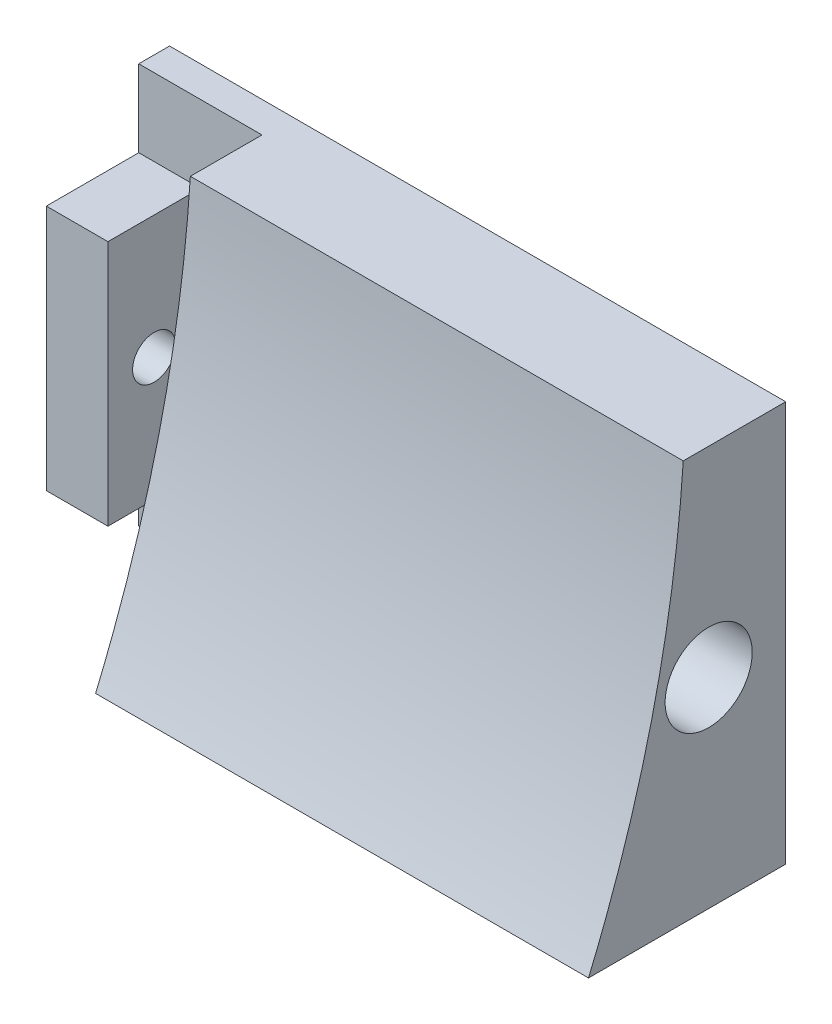
ISO-10303-21;
HEADER;
FILE_DESCRIPTION(('STEP AP214'),'2;1');
FILE_NAME('part.step','',(''),(''),'','','');
FILE_SCHEMA(('AUTOMOTIVE_DESIGN { 1 0 10303 214 1 1 1 1 }'));
ENDSEC;
DATA;
#1=APPLICATION_CONTEXT('core data for automotive mechanical design processes');
#2=APPLICATION_PROTOCOL_DEFINITION('international standard','automotive_design',2000,#1);
#3=PRODUCT_CONTEXT('',#1,'mechanical');
#4=PRODUCT('Part','Part','',(#3));
#5=PRODUCT_RELATED_PRODUCT_CATEGORY('part','',(#4));
#6=PRODUCT_DEFINITION_FORMATION('','',#4);
#7=PRODUCT_DEFINITION_CONTEXT('part definition',#1,'design');
#8=PRODUCT_DEFINITION('design','',#6,#7);
#9=PRODUCT_DEFINITION_SHAPE('','',#8);
#10=(LENGTH_UNIT() NAMED_UNIT(*) SI_UNIT(.MILLI.,.METRE.));
#11=(NAMED_UNIT(*) PLANE_ANGLE_UNIT() SI_UNIT($,.RADIAN.));
#12=(NAMED_UNIT(*) SI_UNIT($,.STERADIAN.) SOLID_ANGLE_UNIT());
#13=UNCERTAINTY_MEASURE_WITH_UNIT(LENGTH_MEASURE(1.E-05),#10,'distance_accuracy_value','');
#14=(GEOMETRIC_REPRESENTATION_CONTEXT(3) GLOBAL_UNCERTAINTY_ASSIGNED_CONTEXT((#13)) GLOBAL_UNIT_ASSIGNED_CONTEXT((#10,
#11,#12)) REPRESENTATION_CONTEXT('',''));
#15=CARTESIAN_POINT('',(0.,0.,0.));
#16=DIRECTION('',(0.,0.,1.));
#17=DIRECTION('',(1.,0.,0.));
#18=AXIS2_PLACEMENT_3D('',#15,#16,#17);
#19=CARTESIAN_POINT('',(0.,0.,2.));
#20=DIRECTION('',(0.,0.,1.));
#21=DIRECTION('',(1.,0.,0.));
#22=AXIS2_PLACEMENT_3D('',#19,#20,#21);
#23=PLANE('',#22);
#24=DIRECTION('',(1.,0.,0.));
#25=VECTOR('',#24,1.);
#26=CARTESIAN_POINT('',(-12.,-37.85,2.));
#27=LINE('',#26,#25);
#28=CARTESIAN_POINT('',(-12.,-37.85,2.));
#29=VERTEX_POINT('',#28);
#30=CARTESIAN_POINT('',(-4.,-37.85,2.));
#31=VERTEX_POINT('',#30);
#32=EDGE_CURVE('E53',#29,#31,#27,.T.);
#33=ORIENTED_EDGE('',*,*,#32,.T.);
#34=DIRECTION('',(0.,1.,0.));
#35=VECTOR('',#34,1.);
#36=CARTESIAN_POINT('',(-4.,0.,2.));
#37=LINE('',#36,#35);
#38=CARTESIAN_POINT('',(-4.,-11.85,2.));
#39=VERTEX_POINT('',#38);
#40=EDGE_CURVE('E48',#31,#39,#37,.T.);
#41=ORIENTED_EDGE('',*,*,#40,.T.);
#42=DIRECTION('',(-1.,0.,0.));
#43=VECTOR('',#42,1.);
#44=CARTESIAN_POINT('',(28.,-11.85,2.));
#45=LINE('',#44,#43);
#46=CARTESIAN_POINT('',(-12.,-11.85,2.));
#47=VERTEX_POINT('',#46);
#48=EDGE_CURVE('E114',#39,#47,#45,.T.);
#49=ORIENTED_EDGE('',*,*,#48,.T.);
#50=DIRECTION('',(0.,-1.,0.));
#51=VECTOR('',#50,1.);
#52=CARTESIAN_POINT('',(-12.,-11.85,2.));
#53=LINE('',#52,#51);
#54=CARTESIAN_POINT('',(-12.,-16.85,2.));
#55=VERTEX_POINT('',#54);
#56=EDGE_CURVE('E250',#47,#55,#53,.T.);
#57=ORIENTED_EDGE('',*,*,#56,.T.);
#58=DIRECTION('',(-1.,0.,0.));
#59=VECTOR('',#58,1.);
#60=CARTESIAN_POINT('',(0.,-16.85,2.));
#61=LINE('',#60,#59);
#62=CARTESIAN_POINT('',(-8.,-16.85,2.));
#63=VERTEX_POINT('',#62);
#64=EDGE_CURVE('E242',#63,#55,#61,.T.);
#65=ORIENTED_EDGE('',*,*,#64,.F.);
#66=DIRECTION('',(0.,-1.,0.));
#67=VECTOR('',#66,1.);
#68=CARTESIAN_POINT('',(-8.,0.,2.));
#69=LINE('',#68,#67);
#70=CARTESIAN_POINT('',(-8.,-32.85,2.));
#71=VERTEX_POINT('',#70);
#72=EDGE_CURVE('E238',#63,#71,#69,.T.);
#73=ORIENTED_EDGE('',*,*,#72,.T.);
#74=DIRECTION('',(1.,0.,0.));
#75=VECTOR('',#74,1.);
#76=CARTESIAN_POINT('',(0.,-32.85,2.));
#77=LINE('',#76,#75);
#78=CARTESIAN_POINT('',(-12.,-32.85,2.));
#79=VERTEX_POINT('',#78);
#80=EDGE_CURVE('E245',#79,#71,#77,.T.);
#81=ORIENTED_EDGE('',*,*,#80,.F.);
#82=EDGE_CURVE('E249',#79,#29,#53,.T.);
#83=ORIENTED_EDGE('',*,*,#82,.T.);
#84=EDGE_LOOP('',(#33,#41,#49,#57,#65,#73,#81,#83));
#85=FACE_BOUND('',#84,.T.);
#86=ADVANCED_FACE('F33',(#85),#23,.T.);
#87=CARTESIAN_POINT('',(28.,-11.85,2.));
#88=DIRECTION('',(0.,-1.,0.));
#89=DIRECTION('',(1.,0.,0.));
#90=AXIS2_PLACEMENT_3D('',#87,#88,#89);
#91=PLANE('',#90);
#92=DIRECTION('',(-1.,0.,0.));
#93=VECTOR('',#92,1.);
#94=CARTESIAN_POINT('',(28.,-11.85,0.));
#95=LINE('',#94,#93);
#96=CARTESIAN_POINT('',(28.,-11.85,0.));
#97=VERTEX_POINT('',#96);
#98=CARTESIAN_POINT('',(-12.,-11.85,0.));
#99=VERTEX_POINT('',#98);
#100=EDGE_CURVE('E197',#97,#99,#95,.T.);
#101=ORIENTED_EDGE('',*,*,#100,.T.);
#102=DIRECTION('',(0.,0.,-1.));
#103=VECTOR('',#102,1.);
#104=CARTESIAN_POINT('',(-12.,-11.85,2.));
#105=LINE('',#104,#103);
#106=EDGE_CURVE('E11',#47,#99,#105,.T.);
#107=ORIENTED_EDGE('',*,*,#106,.F.);
#108=ORIENTED_EDGE('',*,*,#48,.F.);
#109=DIRECTION('',(0.,0.,1.));
#110=VECTOR('',#109,1.);
#111=CARTESIAN_POINT('',(-4.,-11.85,6.65));
#112=LINE('',#111,#110);
#113=CARTESIAN_POINT('',(-4.,-11.85,6.65));
#114=VERTEX_POINT('',#113);
#115=EDGE_CURVE('E108',#39,#114,#112,.T.);
#116=ORIENTED_EDGE('',*,*,#115,.T.);
#117=DIRECTION('',(1.,0.,0.));
#118=VECTOR('',#117,1.);
#119=CARTESIAN_POINT('',(-4.,-11.85,6.65));
#120=LINE('',#119,#118);
#121=CARTESIAN_POINT('',(28.,-11.85,6.65));
#122=VERTEX_POINT('',#121);
#123=EDGE_CURVE('E111',#114,#122,#120,.T.);
#124=ORIENTED_EDGE('',*,*,#123,.T.);
#125=DIRECTION('',(0.,0.,-1.));
#126=VECTOR('',#125,1.);
#127=CARTESIAN_POINT('',(28.,-11.85,2.));
#128=LINE('',#127,#126);
#129=EDGE_CURVE('E207',#122,#97,#128,.T.);
#130=ORIENTED_EDGE('',*,*,#129,.T.);
#131=EDGE_LOOP('',(#101,#107,#108,#116,#124,#130));
#132=FACE_BOUND('',#131,.T.);
#133=ADVANCED_FACE('F35',(#132),#91,.F.);
#134=CARTESIAN_POINT('',(-12.,-11.85,2.));
#135=DIRECTION('',(1.,0.,0.));
#136=DIRECTION('',(0.,1.,0.));
#137=AXIS2_PLACEMENT_3D('',#134,#135,#136);
#138=PLANE('',#137);
#139=CARTESIAN_POINT('',(-12.,-24.85,5.));
#140=DIRECTION('',(-1.,0.,0.));
#141=DIRECTION('',(0.,-1.,0.));
#142=AXIS2_PLACEMENT_3D('',#139,#140,#141);
#143=CIRCLE('',#142,1.4);
#144=CARTESIAN_POINT('',(-12.,-26.25,5.));
#145=VERTEX_POINT('',#144);
#146=EDGE_CURVE('E188',#145,#145,#143,.T.);
#147=ORIENTED_EDGE('',*,*,#146,.F.);
#148=EDGE_LOOP('',(#147));
#149=FACE_BOUND('',#148,.T.);
#150=DIRECTION('',(0.,-1.,0.));
#151=VECTOR('',#150,1.);
#152=CARTESIAN_POINT('',(-12.,-11.85,0.));
#153=LINE('',#152,#151);
#154=CARTESIAN_POINT('',(-12.,-37.85,0.));
#155=VERTEX_POINT('',#154);
#156=EDGE_CURVE('E191',#99,#155,#153,.T.);
#157=ORIENTED_EDGE('',*,*,#156,.T.);
#158=DIRECTION('',(0.,0.,-1.));
#159=VECTOR('',#158,1.);
#160=CARTESIAN_POINT('',(-12.,-37.85,2.));
#161=LINE('',#160,#159);
#162=EDGE_CURVE('E41',#29,#155,#161,.T.);
#163=ORIENTED_EDGE('',*,*,#162,.F.);
#164=ORIENTED_EDGE('',*,*,#82,.F.);
#165=DIRECTION('',(0.,0.,1.));
#166=VECTOR('',#165,1.);
#167=CARTESIAN_POINT('',(-12.,-32.85,0.));
#168=LINE('',#167,#166);
#169=CARTESIAN_POINT('',(-12.,-32.85,8.00000000000001));
#170=VERTEX_POINT('',#169);
#171=EDGE_CURVE('E218',#79,#170,#168,.T.);
#172=ORIENTED_EDGE('',*,*,#171,.T.);
#173=DIRECTION('',(0.,1.,0.));
#174=VECTOR('',#173,1.);
#175=CARTESIAN_POINT('',(-12.,-32.85,8.00000000000001));
#176=LINE('',#175,#174);
#177=CARTESIAN_POINT('',(-12.,-16.85,8.00000000000001));
#178=VERTEX_POINT('',#177);
#179=EDGE_CURVE('E231',#170,#178,#176,.T.);
#180=ORIENTED_EDGE('',*,*,#179,.T.);
#181=DIRECTION('',(0.,0.,-1.));
#182=VECTOR('',#181,1.);
#183=CARTESIAN_POINT('',(-12.,-16.85,0.));
#184=LINE('',#183,#182);
#185=EDGE_CURVE('E223',#178,#55,#184,.T.);
#186=ORIENTED_EDGE('',*,*,#185,.T.);
#187=ORIENTED_EDGE('',*,*,#56,.F.);
#188=ORIENTED_EDGE('',*,*,#106,.T.);
#189=EDGE_LOOP('',(#157,#163,#164,#172,#180,#186,#187,#188));
#190=FACE_BOUND('',#189,.T.);
#191=ADVANCED_FACE('F178',(#149,#190),#138,.F.);
#192=CARTESIAN_POINT('',(-12.,-37.85,2.));
#193=DIRECTION('',(0.,1.,0.));
#194=DIRECTION('',(0.,0.,1.));
#195=AXIS2_PLACEMENT_3D('',#192,#193,#194);
#196=PLANE('',#195);
#197=DIRECTION('',(0.,0.,-1.));
#198=VECTOR('',#197,1.);
#199=CARTESIAN_POINT('',(28.,-37.85,2.));
#200=LINE('',#199,#198);
#201=CARTESIAN_POINT('',(28.,-37.85,12.8));
#202=VERTEX_POINT('',#201);
#203=CARTESIAN_POINT('',(28.,-37.85,0.));
#204=VERTEX_POINT('',#203);
#205=EDGE_CURVE('E200',#202,#204,#200,.T.);
#206=ORIENTED_EDGE('',*,*,#205,.F.);
#207=DIRECTION('',(1.,0.,0.));
#208=VECTOR('',#207,1.);
#209=CARTESIAN_POINT('',(-4.,-37.85,12.8));
#210=LINE('',#209,#208);
#211=CARTESIAN_POINT('',(-4.,-37.85,12.8));
#212=VERTEX_POINT('',#211);
#213=EDGE_CURVE('E126',#212,#202,#210,.T.);
#214=ORIENTED_EDGE('',*,*,#213,.F.);
#215=DIRECTION('',(0.,0.,-1.));
#216=VECTOR('',#215,1.);
#217=CARTESIAN_POINT('',(-4.,-37.85,0.));
#218=LINE('',#217,#216);
#219=EDGE_CURVE('E127',#212,#31,#218,.T.);
#220=ORIENTED_EDGE('',*,*,#219,.T.);
#221=ORIENTED_EDGE('',*,*,#32,.F.);
#222=ORIENTED_EDGE('',*,*,#162,.T.);
#223=DIRECTION('',(1.,0.,0.));
#224=VECTOR('',#223,1.);
#225=CARTESIAN_POINT('',(-12.,-37.85,0.));
#226=LINE('',#225,#224);
#227=EDGE_CURVE('E196',#155,#204,#226,.T.);
#228=ORIENTED_EDGE('',*,*,#227,.T.);
#229=EDGE_LOOP('',(#206,#214,#220,#221,#222,#228));
#230=FACE_BOUND('',#229,.T.);
#231=ADVANCED_FACE('F175',(#230),#196,.F.);
#232=CARTESIAN_POINT('',(28.,-11.85,2.));
#233=DIRECTION('',(-1.,0.,0.));
#234=DIRECTION('',(0.,0.,1.));
#235=AXIS2_PLACEMENT_3D('',#232,#233,#234);
#236=PLANE('',#235);
#237=CARTESIAN_POINT('',(28.,-24.85,5.));
#238=DIRECTION('',(1.,0.,0.));
#239=DIRECTION('',(0.,0.,-1.));
#240=AXIS2_PLACEMENT_3D('',#237,#238,#239);
#241=CIRCLE('',#240,2.82662058916264);
#242=CARTESIAN_POINT('',(28.,-24.85,2.17337941083736));
#243=VERTEX_POINT('',#242);
#244=EDGE_CURVE('E269',#243,#243,#241,.T.);
#245=ORIENTED_EDGE('',*,*,#244,.F.);
#246=EDGE_LOOP('',(#245));
#247=FACE_BOUND('',#246,.T.);
#248=DIRECTION('',(0.,1.,0.));
#249=VECTOR('',#248,1.);
#250=CARTESIAN_POINT('',(28.,-11.85,0.));
#251=LINE('',#250,#249);
#252=EDGE_CURVE('E202',#204,#97,#251,.T.);
#253=ORIENTED_EDGE('',*,*,#252,.T.);
#254=ORIENTED_EDGE('',*,*,#129,.F.);
#255=CARTESIAN_POINT('',(28.,-11.85,6.65));
#256=CARTESIAN_POINT('',(28.,-25.3842366507901,7.55062654661262));
#257=CARTESIAN_POINT('',(28.,-37.85,12.8));
#258=B_SPLINE_CURVE_WITH_KNOTS('',2,(#255,#256,#257),.UNSPECIFIED.,.F.,.F.,(3,3),(0.,1.),.UNSPECIFIED.);
#259=EDGE_CURVE('E118',#122,#202,#258,.T.);
#260=ORIENTED_EDGE('',*,*,#259,.T.);
#261=ORIENTED_EDGE('',*,*,#205,.T.);
#262=EDGE_LOOP('',(#253,#254,#260,#261));
#263=FACE_BOUND('',#262,.T.);
#264=ADVANCED_FACE('F171',(#247,#263),#236,.F.);
#265=CARTESIAN_POINT('',(0.,0.,0.));
#266=DIRECTION('',(0.,0.,1.));
#267=DIRECTION('',(1.,0.,0.));
#268=AXIS2_PLACEMENT_3D('',#265,#266,#267);
#269=PLANE('',#268);
#270=ORIENTED_EDGE('',*,*,#252,.F.);
#271=ORIENTED_EDGE('',*,*,#227,.F.);
#272=ORIENTED_EDGE('',*,*,#156,.F.);
#273=ORIENTED_EDGE('',*,*,#100,.F.);
#274=EDGE_LOOP('',(#270,#271,#272,#273));
#275=FACE_BOUND('',#274,.T.);
#276=ADVANCED_FACE('F165',(#275),#269,.F.);
#277=CARTESIAN_POINT('',(-8.,-32.85,0.));
#278=DIRECTION('',(0.,-1.,0.));
#279=DIRECTION('',(1.,0.,0.));
#280=AXIS2_PLACEMENT_3D('',#277,#278,#279);
#281=PLANE('',#280);
#282=ORIENTED_EDGE('',*,*,#171,.F.);
#283=ORIENTED_EDGE('',*,*,#80,.T.);
#284=DIRECTION('',(0.,0.,1.));
#285=VECTOR('',#284,1.);
#286=CARTESIAN_POINT('',(-8.,-32.85,0.));
#287=LINE('',#286,#285);
#288=CARTESIAN_POINT('',(-8.,-32.85,8.00000000000001));
#289=VERTEX_POINT('',#288);
#290=EDGE_CURVE('E220',#71,#289,#287,.T.);
#291=ORIENTED_EDGE('',*,*,#290,.T.);
#292=DIRECTION('',(-1.,0.,0.));
#293=VECTOR('',#292,1.);
#294=CARTESIAN_POINT('',(-8.,-32.85,8.00000000000001));
#295=LINE('',#294,#293);
#296=EDGE_CURVE('E229',#289,#170,#295,.T.);
#297=ORIENTED_EDGE('',*,*,#296,.T.);
#298=EDGE_LOOP('',(#282,#283,#291,#297));
#299=FACE_BOUND('',#298,.T.);
#300=ADVANCED_FACE('F158',(#299),#281,.T.);
#301=CARTESIAN_POINT('',(-8.,-16.85,0.));
#302=DIRECTION('',(0.,1.,0.));
#303=DIRECTION('',(-1.,0.,0.));
#304=AXIS2_PLACEMENT_3D('',#301,#302,#303);
#305=PLANE('',#304);
#306=DIRECTION('',(0.,0.,-1.));
#307=VECTOR('',#306,1.);
#308=CARTESIAN_POINT('',(-8.,-16.85,0.));
#309=LINE('',#308,#307);
#310=CARTESIAN_POINT('',(-8.,-16.85,8.00000000000001));
#311=VERTEX_POINT('',#310);
#312=EDGE_CURVE('E226',#311,#63,#309,.T.);
#313=ORIENTED_EDGE('',*,*,#312,.T.);
#314=ORIENTED_EDGE('',*,*,#64,.T.);
#315=ORIENTED_EDGE('',*,*,#185,.F.);
#316=DIRECTION('',(-1.,0.,0.));
#317=VECTOR('',#316,1.);
#318=CARTESIAN_POINT('',(-8.,-16.85,8.00000000000001));
#319=LINE('',#318,#317);
#320=EDGE_CURVE('E236',#311,#178,#319,.T.);
#321=ORIENTED_EDGE('',*,*,#320,.F.);
#322=EDGE_LOOP('',(#313,#314,#315,#321));
#323=FACE_BOUND('',#322,.T.);
#324=ADVANCED_FACE('F155',(#323),#305,.T.);
#325=CARTESIAN_POINT('',(-8.,-32.85,8.00000000000001));
#326=DIRECTION('',(0.,0.,1.));
#327=DIRECTION('',(1.,0.,0.));
#328=AXIS2_PLACEMENT_3D('',#325,#326,#327);
#329=PLANE('',#328);
#330=ORIENTED_EDGE('',*,*,#179,.F.);
#331=ORIENTED_EDGE('',*,*,#296,.F.);
#332=DIRECTION('',(0.,1.,0.));
#333=VECTOR('',#332,1.);
#334=CARTESIAN_POINT('',(-8.,-32.85,8.00000000000001));
#335=LINE('',#334,#333);
#336=EDGE_CURVE('E222',#289,#311,#335,.T.);
#337=ORIENTED_EDGE('',*,*,#336,.T.);
#338=ORIENTED_EDGE('',*,*,#320,.T.);
#339=EDGE_LOOP('',(#330,#331,#337,#338));
#340=FACE_BOUND('',#339,.T.);
#341=ADVANCED_FACE('F153',(#340),#329,.T.);
#342=CARTESIAN_POINT('',(-8.,0.,0.));
#343=DIRECTION('',(-1.,0.,0.));
#344=DIRECTION('',(0.,-1.,0.));
#345=AXIS2_PLACEMENT_3D('',#342,#343,#344);
#346=PLANE('',#345);
#347=CARTESIAN_POINT('',(-8.,-24.85,5.));
#348=DIRECTION('',(-1.,0.,0.));
#349=DIRECTION('',(0.,-1.,0.));
#350=AXIS2_PLACEMENT_3D('',#347,#348,#349);
#351=CIRCLE('',#350,1.4);
#352=CARTESIAN_POINT('',(-8.,-26.25,5.));
#353=VERTEX_POINT('',#352);
#354=EDGE_CURVE('E215',#353,#353,#351,.T.);
#355=ORIENTED_EDGE('',*,*,#354,.T.);
#356=EDGE_LOOP('',(#355));
#357=FACE_BOUND('',#356,.T.);
#358=ORIENTED_EDGE('',*,*,#72,.F.);
#359=ORIENTED_EDGE('',*,*,#312,.F.);
#360=ORIENTED_EDGE('',*,*,#336,.F.);
#361=ORIENTED_EDGE('',*,*,#290,.F.);
#362=EDGE_LOOP('',(#358,#359,#360,#361));
#363=FACE_BOUND('',#362,.T.);
#364=ADVANCED_FACE('F149',(#357,#363),#346,.F.);
#365=CARTESIAN_POINT('',(-8.,-24.85,5.));
#366=DIRECTION('',(-1.,0.,0.));
#367=DIRECTION('',(0.,-1.,0.));
#368=AXIS2_PLACEMENT_3D('',#365,#366,#367);
#369=CYLINDRICAL_SURFACE('',#368,1.4);
#370=ORIENTED_EDGE('',*,*,#354,.F.);
#371=EDGE_LOOP('',(#370));
#372=FACE_BOUND('',#371,.T.);
#373=ORIENTED_EDGE('',*,*,#146,.T.);
#374=EDGE_LOOP('',(#373));
#375=FACE_BOUND('',#374,.T.);
#376=ADVANCED_FACE('F145',(#372,#375),#369,.F.);
#377=CARTESIAN_POINT('',(-4.,-11.85,6.65));
#378=CARTESIAN_POINT('',(-4.,-25.3842366507901,7.55062654661262));
#379=CARTESIAN_POINT('',(-4.,-37.85,12.8));
#380=B_SPLINE_CURVE_WITH_KNOTS('',2,(#377,#378,#379),.UNSPECIFIED.,.F.,.F.,(3,3),(0.,1.),.UNSPECIFIED.);
#381=DIRECTION('',(1.,0.,0.));
#382=VECTOR('',#381,1.);
#383=SURFACE_OF_LINEAR_EXTRUSION('',#380,#382);
#384=ORIENTED_EDGE('',*,*,#259,.F.);
#385=ORIENTED_EDGE('',*,*,#123,.F.);
#386=EDGE_CURVE('E117',#114,#212,#380,.T.);
#387=ORIENTED_EDGE('',*,*,#386,.T.);
#388=ORIENTED_EDGE('',*,*,#213,.T.);
#389=EDGE_LOOP('',(#384,#385,#387,#388));
#390=FACE_BOUND('',#389,.T.);
#391=ADVANCED_FACE('F122',(#390),#383,.T.);
#392=CARTESIAN_POINT('',(-4.,-25.1171183253951,8.63781327330631));
#393=DIRECTION('',(1.,0.,0.));
#394=DIRECTION('',(0.,0.,-1.));
#395=AXIS2_PLACEMENT_3D('',#392,#393,#394);
#396=PLANE('',#395);
#397=CARTESIAN_POINT('',(-4.,-24.85,5.));
#398=DIRECTION('',(1.,0.,0.));
#399=DIRECTION('',(0.,0.,-1.));
#400=AXIS2_PLACEMENT_3D('',#397,#398,#399);
#401=CIRCLE('',#400,2.82662058916264);
#402=CARTESIAN_POINT('',(-4.,-24.85,2.17337941083736));
#403=VERTEX_POINT('',#402);
#404=EDGE_CURVE('E264',#403,#403,#401,.T.);
#405=ORIENTED_EDGE('',*,*,#404,.T.);
#406=EDGE_LOOP('',(#405));
#407=FACE_BOUND('',#406,.T.);
#408=ORIENTED_EDGE('',*,*,#40,.F.);
#409=ORIENTED_EDGE('',*,*,#219,.F.);
#410=ORIENTED_EDGE('',*,*,#386,.F.);
#411=ORIENTED_EDGE('',*,*,#115,.F.);
#412=EDGE_LOOP('',(#408,#409,#410,#411));
#413=FACE_BOUND('',#412,.T.);
#414=ADVANCED_FACE('F129',(#407,#413),#396,.F.);
#415=CARTESIAN_POINT('',(-4.,-24.85,5.));
#416=DIRECTION('',(1.,0.,0.));
#417=DIRECTION('',(0.,0.,-1.));
#418=AXIS2_PLACEMENT_3D('',#415,#416,#417);
#419=CYLINDRICAL_SURFACE('',#418,2.82662058916264);
#420=ORIENTED_EDGE('',*,*,#404,.F.);
#421=EDGE_LOOP('',(#420));
#422=FACE_BOUND('',#421,.T.);
#423=ORIENTED_EDGE('',*,*,#244,.T.);
#424=EDGE_LOOP('',(#423));
#425=FACE_BOUND('',#424,.T.);
#426=ADVANCED_FACE('F276',(#422,#425),#419,.F.);
#427=CLOSED_SHELL('',(#86,#133,#191,#231,#264,#276,#300,#324,#341,#364,#376,#391,#414,#426));
#428=MANIFOLD_SOLID_BREP('B2',#427);
#429=ADVANCED_BREP_SHAPE_REPRESENTATION('',(#18,#428),#14);
#430=SHAPE_DEFINITION_REPRESENTATION(#9,#429);
ENDSEC;
END-ISO-10303-21;
